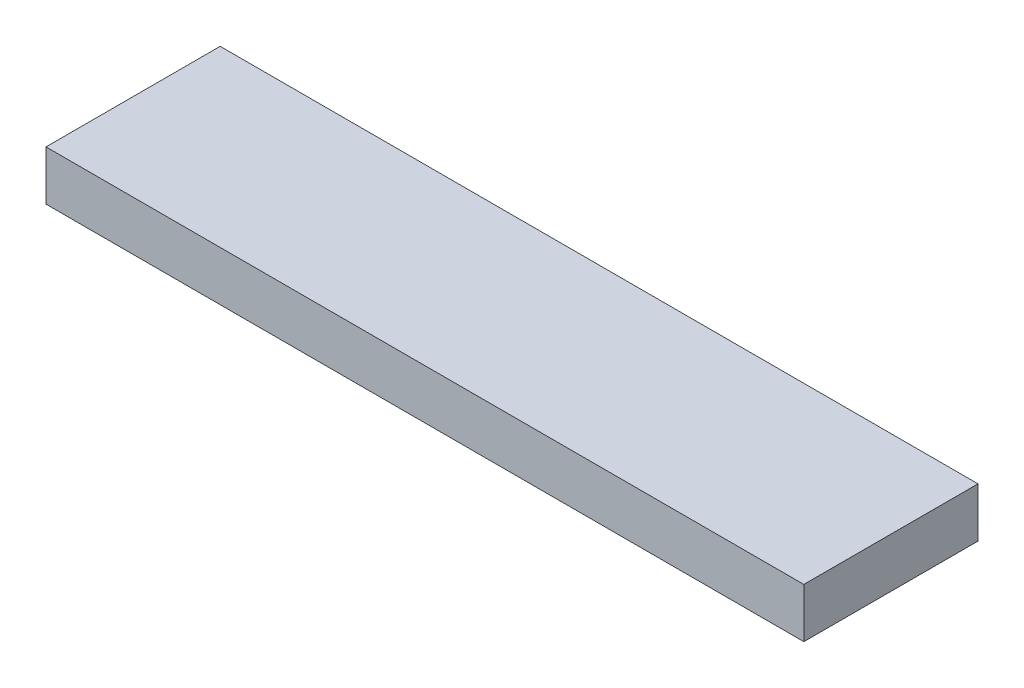
ISO-10303-21;
HEADER;
FILE_DESCRIPTION(('STEP AP214'),'2;1');
FILE_NAME('part.step','',(''),(''),'','','');
FILE_SCHEMA(('AUTOMOTIVE_DESIGN { 1 0 10303 214 1 1 1 1 }'));
ENDSEC;
DATA;
#1=APPLICATION_CONTEXT('core data for automotive mechanical design processes');
#2=APPLICATION_PROTOCOL_DEFINITION('international standard','automotive_design',2000,#1);
#3=PRODUCT_CONTEXT('',#1,'mechanical');
#4=PRODUCT('Part','Part','',(#3));
#5=PRODUCT_RELATED_PRODUCT_CATEGORY('part','',(#4));
#6=PRODUCT_DEFINITION_FORMATION('','',#4);
#7=PRODUCT_DEFINITION_CONTEXT('part definition',#1,'design');
#8=PRODUCT_DEFINITION('design','',#6,#7);
#9=PRODUCT_DEFINITION_SHAPE('','',#8);
#10=(LENGTH_UNIT() NAMED_UNIT(*) SI_UNIT(.MILLI.,.METRE.));
#11=(NAMED_UNIT(*) PLANE_ANGLE_UNIT() SI_UNIT($,.RADIAN.));
#12=(NAMED_UNIT(*) SI_UNIT($,.STERADIAN.) SOLID_ANGLE_UNIT());
#13=UNCERTAINTY_MEASURE_WITH_UNIT(LENGTH_MEASURE(1.E-05),#10,'distance_accuracy_value','');
#14=(GEOMETRIC_REPRESENTATION_CONTEXT(3) GLOBAL_UNCERTAINTY_ASSIGNED_CONTEXT((#13)) GLOBAL_UNIT_ASSIGNED_CONTEXT((#10,
#11,#12)) REPRESENTATION_CONTEXT('',''));
#15=CARTESIAN_POINT('',(0.,0.,0.));
#16=DIRECTION('',(0.,0.,1.));
#17=DIRECTION('',(1.,0.,0.));
#18=AXIS2_PLACEMENT_3D('',#15,#16,#17);
#19=CARTESIAN_POINT('',(86.0227004277145,-24.8316668095739,73.7403657428578));
#20=DIRECTION('',(1.,0.,0.));
#21=DIRECTION('',(0.,0.,-1.));
#22=AXIS2_PLACEMENT_3D('',#19,#20,#21);
#23=PLANE('',#22);
#24=DIRECTION('',(0.,0.,1.));
#25=VECTOR('',#24,1.);
#26=CARTESIAN_POINT('',(86.0227004277145,-31.1816668095739,73.7403657428578));
#27=LINE('',#26,#25);
#28=CARTESIAN_POINT('',(86.0227004277145,-31.1816668095739,51.4391657428578));
#29=VERTEX_POINT('',#28);
#30=CARTESIAN_POINT('',(86.0227004277145,-31.1816668095739,73.7403657428578));
#31=VERTEX_POINT('',#30);
#32=EDGE_CURVE('E96',#29,#31,#27,.T.);
#33=ORIENTED_EDGE('',*,*,#32,.T.);
#34=DIRECTION('',(0.,-1.,0.));
#35=VECTOR('',#34,1.);
#36=CARTESIAN_POINT('',(86.0227004277145,-24.8316668095739,73.7403657428578));
#37=LINE('',#36,#35);
#38=CARTESIAN_POINT('',(86.0227004277145,-24.8316668095739,73.7403657428578));
#39=VERTEX_POINT('',#38);
#40=EDGE_CURVE('E11',#39,#31,#37,.T.);
#41=ORIENTED_EDGE('',*,*,#40,.F.);
#42=DIRECTION('',(0.,0.,1.));
#43=VECTOR('',#42,1.);
#44=CARTESIAN_POINT('',(86.0227004277145,-24.8316668095739,73.7403657428578));
#45=LINE('',#44,#43);
#46=CARTESIAN_POINT('',(86.0227004277145,-24.8316668095739,51.4391657428578));
#47=VERTEX_POINT('',#46);
#48=EDGE_CURVE('E84',#47,#39,#45,.T.);
#49=ORIENTED_EDGE('',*,*,#48,.F.);
#50=DIRECTION('',(0.,-1.,0.));
#51=VECTOR('',#50,1.);
#52=CARTESIAN_POINT('',(86.0227004277145,-24.8316668095739,51.4391657428578));
#53=LINE('',#52,#51);
#54=EDGE_CURVE('E92',#47,#29,#53,.T.);
#55=ORIENTED_EDGE('',*,*,#54,.T.);
#56=EDGE_LOOP('',(#33,#41,#49,#55));
#57=FACE_BOUND('',#56,.T.);
#58=ADVANCED_FACE('F33',(#57),#23,.F.);
#59=CARTESIAN_POINT('',(86.0227004277145,-24.8316668095739,73.7403657428578));
#60=DIRECTION('',(0.,0.,-1.));
#61=DIRECTION('',(-1.,0.,0.));
#62=AXIS2_PLACEMENT_3D('',#59,#60,#61);
#63=PLANE('',#62);
#64=DIRECTION('',(1.,0.,0.));
#65=VECTOR('',#64,1.);
#66=CARTESIAN_POINT('',(86.0227004277145,-31.1816668095739,73.7403657428578));
#67=LINE('',#66,#65);
#68=CARTESIAN_POINT('',(183.050700427714,-31.1816668095739,73.7403657428578));
#69=VERTEX_POINT('',#68);
#70=EDGE_CURVE('E88',#31,#69,#67,.T.);
#71=ORIENTED_EDGE('',*,*,#70,.T.);
#72=DIRECTION('',(0.,-1.,0.));
#73=VECTOR('',#72,1.);
#74=CARTESIAN_POINT('',(183.050700427714,-24.8316668095739,73.7403657428578));
#75=LINE('',#74,#73);
#76=CARTESIAN_POINT('',(183.050700427714,-24.8316668095739,73.7403657428578));
#77=VERTEX_POINT('',#76);
#78=EDGE_CURVE('E41',#77,#69,#75,.T.);
#79=ORIENTED_EDGE('',*,*,#78,.F.);
#80=DIRECTION('',(1.,0.,0.));
#81=VECTOR('',#80,1.);
#82=CARTESIAN_POINT('',(86.0227004277145,-24.8316668095739,73.7403657428578));
#83=LINE('',#82,#81);
#84=EDGE_CURVE('E79',#39,#77,#83,.T.);
#85=ORIENTED_EDGE('',*,*,#84,.F.);
#86=ORIENTED_EDGE('',*,*,#40,.T.);
#87=EDGE_LOOP('',(#71,#79,#85,#86));
#88=FACE_BOUND('',#87,.T.);
#89=ADVANCED_FACE('F87',(#88),#63,.F.);
#90=CARTESIAN_POINT('',(183.050700427714,-24.8316668095739,73.7403657428578));
#91=DIRECTION('',(-1.,0.,0.));
#92=DIRECTION('',(0.,0.,1.));
#93=AXIS2_PLACEMENT_3D('',#90,#91,#92);
#94=PLANE('',#93);
#95=DIRECTION('',(0.,0.,-1.));
#96=VECTOR('',#95,1.);
#97=CARTESIAN_POINT('',(183.050700427714,-31.1816668095739,73.7403657428578));
#98=LINE('',#97,#96);
#99=CARTESIAN_POINT('',(183.050700427714,-31.1816668095739,51.4391657428578));
#100=VERTEX_POINT('',#99);
#101=EDGE_CURVE('E66',#69,#100,#98,.T.);
#102=ORIENTED_EDGE('',*,*,#101,.T.);
#103=DIRECTION('',(0.,-1.,0.));
#104=VECTOR('',#103,1.);
#105=CARTESIAN_POINT('',(183.050700427714,-24.8316668095739,51.4391657428578));
#106=LINE('',#105,#104);
#107=CARTESIAN_POINT('',(183.050700427714,-24.8316668095739,51.4391657428578));
#108=VERTEX_POINT('',#107);
#109=EDGE_CURVE('E89',#108,#100,#106,.T.);
#110=ORIENTED_EDGE('',*,*,#109,.F.);
#111=DIRECTION('',(0.,0.,-1.));
#112=VECTOR('',#111,1.);
#113=CARTESIAN_POINT('',(183.050700427714,-24.8316668095739,73.7403657428578));
#114=LINE('',#113,#112);
#115=EDGE_CURVE('E82',#77,#108,#114,.T.);
#116=ORIENTED_EDGE('',*,*,#115,.F.);
#117=ORIENTED_EDGE('',*,*,#78,.T.);
#118=EDGE_LOOP('',(#102,#110,#116,#117));
#119=FACE_BOUND('',#118,.T.);
#120=ADVANCED_FACE('F90',(#119),#94,.F.);
#121=CARTESIAN_POINT('',(86.0227004277145,-24.8316668095739,51.4391657428578));
#122=DIRECTION('',(0.,0.,1.));
#123=DIRECTION('',(1.,0.,0.));
#124=AXIS2_PLACEMENT_3D('',#121,#122,#123);
#125=PLANE('',#124);
#126=DIRECTION('',(-1.,0.,0.));
#127=VECTOR('',#126,1.);
#128=CARTESIAN_POINT('',(86.0227004277145,-31.1816668095739,51.4391657428578));
#129=LINE('',#128,#127);
#130=EDGE_CURVE('E72',#100,#29,#129,.T.);
#131=ORIENTED_EDGE('',*,*,#130,.T.);
#132=ORIENTED_EDGE('',*,*,#54,.F.);
#133=DIRECTION('',(-1.,0.,0.));
#134=VECTOR('',#133,1.);
#135=CARTESIAN_POINT('',(86.0227004277145,-24.8316668095739,51.4391657428578));
#136=LINE('',#135,#134);
#137=EDGE_CURVE('E49',#108,#47,#136,.T.);
#138=ORIENTED_EDGE('',*,*,#137,.F.);
#139=ORIENTED_EDGE('',*,*,#109,.T.);
#140=EDGE_LOOP('',(#131,#132,#138,#139));
#141=FACE_BOUND('',#140,.T.);
#142=ADVANCED_FACE('F103',(#141),#125,.F.);
#143=CARTESIAN_POINT('',(0.,-24.8316668095739,0.));
#144=DIRECTION('',(0.,-1.,0.));
#145=DIRECTION('',(0.,0.,-1.));
#146=AXIS2_PLACEMENT_3D('',#143,#144,#145);
#147=PLANE('',#146);
#148=ORIENTED_EDGE('',*,*,#48,.T.);
#149=ORIENTED_EDGE('',*,*,#84,.T.);
#150=ORIENTED_EDGE('',*,*,#115,.T.);
#151=ORIENTED_EDGE('',*,*,#137,.T.);
#152=EDGE_LOOP('',(#148,#149,#150,#151));
#153=FACE_BOUND('',#152,.T.);
#154=ADVANCED_FACE('F80',(#153),#147,.F.);
#155=CARTESIAN_POINT('',(0.,-31.1816668095739,0.));
#156=DIRECTION('',(0.,-1.,0.));
#157=DIRECTION('',(0.,0.,-1.));
#158=AXIS2_PLACEMENT_3D('',#155,#156,#157);
#159=PLANE('',#158);
#160=ORIENTED_EDGE('',*,*,#32,.F.);
#161=ORIENTED_EDGE('',*,*,#130,.F.);
#162=ORIENTED_EDGE('',*,*,#101,.F.);
#163=ORIENTED_EDGE('',*,*,#70,.F.);
#164=EDGE_LOOP('',(#160,#161,#162,#163));
#165=FACE_BOUND('',#164,.T.);
#166=ADVANCED_FACE('F106',(#165),#159,.T.);
#167=CLOSED_SHELL('',(#58,#89,#120,#142,#154,#166));
#168=MANIFOLD_SOLID_BREP('B2',#167);
#169=ADVANCED_BREP_SHAPE_REPRESENTATION('',(#18,#168),#14);
#170=SHAPE_DEFINITION_REPRESENTATION(#9,#169);
ENDSEC;
END-ISO-10303-21;
